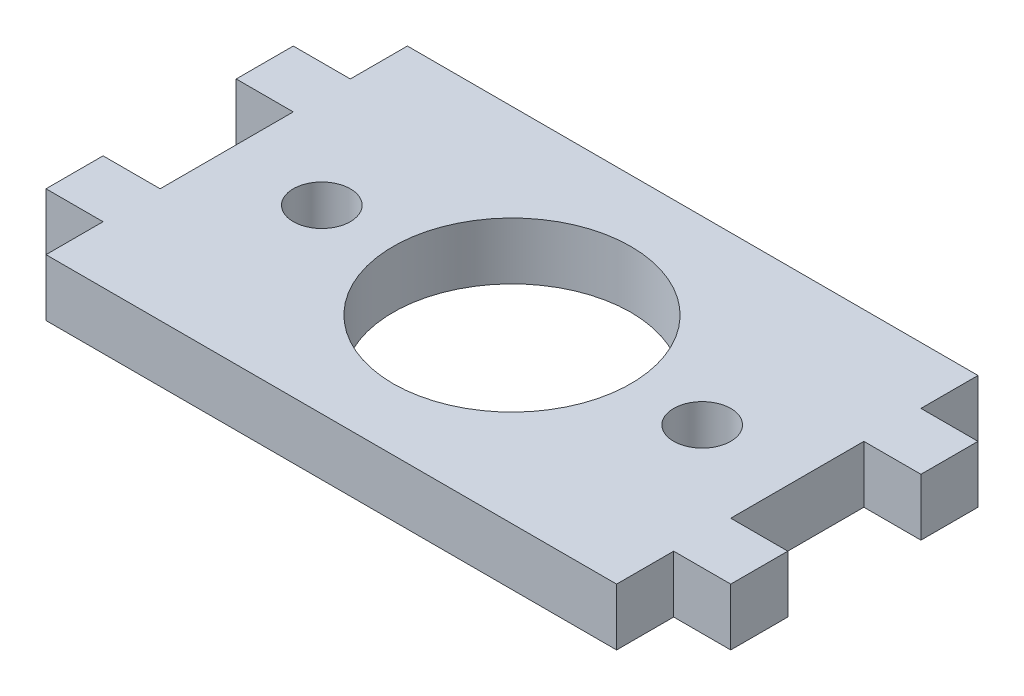
ISO-10303-21;
HEADER;
FILE_DESCRIPTION(('STEP AP214'),'2;1');
FILE_NAME('part.step','',(''),(''),'','','');
FILE_SCHEMA(('AUTOMOTIVE_DESIGN { 1 0 10303 214 1 1 1 1 }'));
ENDSEC;
DATA;
#1=APPLICATION_CONTEXT('core data for automotive mechanical design processes');
#2=APPLICATION_PROTOCOL_DEFINITION('international standard','automotive_design',2000,#1);
#3=PRODUCT_CONTEXT('',#1,'mechanical');
#4=PRODUCT('Part','Part','',(#3));
#5=PRODUCT_RELATED_PRODUCT_CATEGORY('part','',(#4));
#6=PRODUCT_DEFINITION_FORMATION('','',#4);
#7=PRODUCT_DEFINITION_CONTEXT('part definition',#1,'design');
#8=PRODUCT_DEFINITION('design','',#6,#7);
#9=PRODUCT_DEFINITION_SHAPE('','',#8);
#10=(LENGTH_UNIT() NAMED_UNIT(*) SI_UNIT(.MILLI.,.METRE.));
#11=(NAMED_UNIT(*) PLANE_ANGLE_UNIT() SI_UNIT($,.RADIAN.));
#12=(NAMED_UNIT(*) SI_UNIT($,.STERADIAN.) SOLID_ANGLE_UNIT());
#13=UNCERTAINTY_MEASURE_WITH_UNIT(LENGTH_MEASURE(1.E-05),#10,'distance_accuracy_value','');
#14=(GEOMETRIC_REPRESENTATION_CONTEXT(3) GLOBAL_UNCERTAINTY_ASSIGNED_CONTEXT((#13)) GLOBAL_UNIT_ASSIGNED_CONTEXT((#10,
#11,#12)) REPRESENTATION_CONTEXT('',''));
#15=CARTESIAN_POINT('',(0.,0.,0.));
#16=DIRECTION('',(0.,0.,1.));
#17=DIRECTION('',(1.,0.,0.));
#18=AXIS2_PLACEMENT_3D('',#15,#16,#17);
#19=CARTESIAN_POINT('',(0.,3.,0.));
#20=DIRECTION('',(0.,-1.,0.));
#21=DIRECTION('',(0.,0.,-1.));
#22=AXIS2_PLACEMENT_3D('',#19,#20,#21);
#23=PLANE('',#22);
#24=CARTESIAN_POINT('',(-34.8674121918661,3.,-3.5));
#25=DIRECTION('',(0.,1.,0.));
#26=DIRECTION('',(0.,0.,1.));
#27=AXIS2_PLACEMENT_3D('',#24,#25,#26);
#28=CIRCLE('',#27,1.5);
#29=CARTESIAN_POINT('',(-34.8674121918661,3.,-1.99999999999999));
#30=VERTEX_POINT('',#29);
#31=EDGE_CURVE('E389',#30,#30,#28,.T.);
#32=ORIENTED_EDGE('',*,*,#31,.F.);
#33=EDGE_LOOP('',(#32));
#34=FACE_BOUND('',#33,.T.);
#35=DIRECTION('',(1.,0.,0.));
#36=VECTOR('',#35,1.);
#37=CARTESIAN_POINT('',(-39.8674121918661,3.,-7.));
#38=LINE('',#37,#36);
#39=CARTESIAN_POINT('',(-42.8674121918661,3.,-7.));
#40=VERTEX_POINT('',#39);
#41=CARTESIAN_POINT('',(-39.8674121918661,3.,-7.));
#42=VERTEX_POINT('',#41);
#43=EDGE_CURVE('E239',#40,#42,#38,.T.);
#44=ORIENTED_EDGE('',*,*,#43,.T.);
#45=DIRECTION('',(0.,0.,1.));
#46=VECTOR('',#45,1.);
#47=CARTESIAN_POINT('',(-39.8674121918661,3.,0.));
#48=LINE('',#47,#46);
#49=CARTESIAN_POINT('',(-39.8674121918661,3.,0.));
#50=VERTEX_POINT('',#49);
#51=EDGE_CURVE('E127',#42,#50,#48,.T.);
#52=ORIENTED_EDGE('',*,*,#51,.T.);
#53=DIRECTION('',(-1.,0.,0.));
#54=VECTOR('',#53,1.);
#55=CARTESIAN_POINT('',(-42.8674121918661,3.,0.));
#56=LINE('',#55,#54);
#57=CARTESIAN_POINT('',(-42.8674121918661,3.,0.));
#58=VERTEX_POINT('',#57);
#59=EDGE_CURVE('E290',#50,#58,#56,.T.);
#60=ORIENTED_EDGE('',*,*,#59,.T.);
#61=DIRECTION('',(0.,0.,1.));
#62=VECTOR('',#61,1.);
#63=CARTESIAN_POINT('',(-42.8674121918661,3.,3.));
#64=LINE('',#63,#62);
#65=CARTESIAN_POINT('',(-42.8674121918661,3.,3.));
#66=VERTEX_POINT('',#65);
#67=EDGE_CURVE('E309',#58,#66,#64,.T.);
#68=ORIENTED_EDGE('',*,*,#67,.T.);
#69=DIRECTION('',(1.,0.,0.));
#70=VECTOR('',#69,1.);
#71=CARTESIAN_POINT('',(-39.8674121918661,3.,3.));
#72=LINE('',#71,#70);
#73=CARTESIAN_POINT('',(-39.8674121918661,3.,3.));
#74=VERTEX_POINT('',#73);
#75=EDGE_CURVE('E306',#66,#74,#72,.T.);
#76=ORIENTED_EDGE('',*,*,#75,.T.);
#77=DIRECTION('',(0.,0.,1.));
#78=VECTOR('',#77,1.);
#79=CARTESIAN_POINT('',(-39.8674121918661,3.,5.99999999999999));
#80=LINE('',#79,#78);
#81=CARTESIAN_POINT('',(-39.8674121918661,3.,5.99999999999999));
#82=VERTEX_POINT('',#81);
#83=EDGE_CURVE('E308',#74,#82,#80,.T.);
#84=ORIENTED_EDGE('',*,*,#83,.T.);
#85=DIRECTION('',(1.,0.,0.));
#86=VECTOR('',#85,1.);
#87=CARTESIAN_POINT('',(-9.86741219186607,3.,5.99999999999999));
#88=LINE('',#87,#86);
#89=CARTESIAN_POINT('',(-9.86741219186607,3.,5.99999999999999));
#90=VERTEX_POINT('',#89);
#91=EDGE_CURVE('E311',#82,#90,#88,.T.);
#92=ORIENTED_EDGE('',*,*,#91,.T.);
#93=DIRECTION('',(0.,0.,-1.));
#94=VECTOR('',#93,1.);
#95=CARTESIAN_POINT('',(-9.86741219186607,3.,3.));
#96=LINE('',#95,#94);
#97=CARTESIAN_POINT('',(-9.86741219186607,3.,3.));
#98=VERTEX_POINT('',#97);
#99=EDGE_CURVE('E317',#90,#98,#96,.T.);
#100=ORIENTED_EDGE('',*,*,#99,.T.);
#101=DIRECTION('',(1.,0.,0.));
#102=VECTOR('',#101,1.);
#103=CARTESIAN_POINT('',(-6.86741219186606,3.,3.));
#104=LINE('',#103,#102);
#105=CARTESIAN_POINT('',(-6.86741219186606,3.,3.));
#106=VERTEX_POINT('',#105);
#107=EDGE_CURVE('E319',#98,#106,#104,.T.);
#108=ORIENTED_EDGE('',*,*,#107,.T.);
#109=DIRECTION('',(0.,0.,-1.));
#110=VECTOR('',#109,1.);
#111=CARTESIAN_POINT('',(-6.86741219186606,3.,0.));
#112=LINE('',#111,#110);
#113=CARTESIAN_POINT('',(-6.86741219186606,3.,0.));
#114=VERTEX_POINT('',#113);
#115=EDGE_CURVE('E321',#106,#114,#112,.T.);
#116=ORIENTED_EDGE('',*,*,#115,.T.);
#117=DIRECTION('',(-1.,0.,0.));
#118=VECTOR('',#117,1.);
#119=CARTESIAN_POINT('',(-9.86741219186607,3.,0.));
#120=LINE('',#119,#118);
#121=CARTESIAN_POINT('',(-9.86741219186607,3.,0.));
#122=VERTEX_POINT('',#121);
#123=EDGE_CURVE('E323',#114,#122,#120,.T.);
#124=ORIENTED_EDGE('',*,*,#123,.T.);
#125=DIRECTION('',(0.,0.,-1.));
#126=VECTOR('',#125,1.);
#127=CARTESIAN_POINT('',(-9.86741219186607,3.,-7.));
#128=LINE('',#127,#126);
#129=CARTESIAN_POINT('',(-9.86741219186607,3.,-7.));
#130=VERTEX_POINT('',#129);
#131=EDGE_CURVE('E325',#122,#130,#128,.T.);
#132=ORIENTED_EDGE('',*,*,#131,.T.);
#133=DIRECTION('',(1.,0.,0.));
#134=VECTOR('',#133,1.);
#135=CARTESIAN_POINT('',(-6.86741219186607,3.,-7.));
#136=LINE('',#135,#134);
#137=CARTESIAN_POINT('',(-6.86741219186607,3.,-7.));
#138=VERTEX_POINT('',#137);
#139=EDGE_CURVE('E327',#130,#138,#136,.T.);
#140=ORIENTED_EDGE('',*,*,#139,.T.);
#141=DIRECTION('',(0.,0.,-1.));
#142=VECTOR('',#141,1.);
#143=CARTESIAN_POINT('',(-6.86741219186607,3.,-9.99999999999999));
#144=LINE('',#143,#142);
#145=CARTESIAN_POINT('',(-6.86741219186607,3.,-9.99999999999999));
#146=VERTEX_POINT('',#145);
#147=EDGE_CURVE('E329',#138,#146,#144,.T.);
#148=ORIENTED_EDGE('',*,*,#147,.T.);
#149=DIRECTION('',(-1.,0.,0.));
#150=VECTOR('',#149,1.);
#151=CARTESIAN_POINT('',(-9.86741219186607,3.,-9.99999999999999));
#152=LINE('',#151,#150);
#153=CARTESIAN_POINT('',(-9.86741219186607,3.,-9.99999999999999));
#154=VERTEX_POINT('',#153);
#155=EDGE_CURVE('E331',#146,#154,#152,.T.);
#156=ORIENTED_EDGE('',*,*,#155,.T.);
#157=DIRECTION('',(0.,0.,-1.));
#158=VECTOR('',#157,1.);
#159=CARTESIAN_POINT('',(-9.86741219186607,3.,-13.));
#160=LINE('',#159,#158);
#161=CARTESIAN_POINT('',(-9.86741219186607,3.,-13.));
#162=VERTEX_POINT('',#161);
#163=EDGE_CURVE('E333',#154,#162,#160,.T.);
#164=ORIENTED_EDGE('',*,*,#163,.T.);
#165=DIRECTION('',(-1.,0.,0.));
#166=VECTOR('',#165,1.);
#167=CARTESIAN_POINT('',(-39.8674121918661,3.,-13.));
#168=LINE('',#167,#166);
#169=CARTESIAN_POINT('',(-39.8674121918661,3.,-13.));
#170=VERTEX_POINT('',#169);
#171=EDGE_CURVE('E182',#162,#170,#168,.T.);
#172=ORIENTED_EDGE('',*,*,#171,.T.);
#173=DIRECTION('',(0.,0.,1.));
#174=VECTOR('',#173,1.);
#175=CARTESIAN_POINT('',(-39.8674121918661,3.,-9.99999999999999));
#176=LINE('',#175,#174);
#177=CARTESIAN_POINT('',(-39.8674121918661,3.,-9.99999999999999));
#178=VERTEX_POINT('',#177);
#179=EDGE_CURVE('E176',#170,#178,#176,.T.);
#180=ORIENTED_EDGE('',*,*,#179,.T.);
#181=DIRECTION('',(-1.,0.,0.));
#182=VECTOR('',#181,1.);
#183=CARTESIAN_POINT('',(-42.8674121918661,3.,-9.99999999999999));
#184=LINE('',#183,#182);
#185=CARTESIAN_POINT('',(-42.8674121918661,3.,-9.99999999999999));
#186=VERTEX_POINT('',#185);
#187=EDGE_CURVE('E180',#178,#186,#184,.T.);
#188=ORIENTED_EDGE('',*,*,#187,.T.);
#189=DIRECTION('',(0.,0.,1.));
#190=VECTOR('',#189,1.);
#191=CARTESIAN_POINT('',(-42.8674121918661,3.,-7.));
#192=LINE('',#191,#190);
#193=EDGE_CURVE('E48',#186,#40,#192,.T.);
#194=ORIENTED_EDGE('',*,*,#193,.T.);
#195=EDGE_LOOP('',(#44,#52,#60,#68,#76,#84,#92,#100,#108,#116,#124,#132,#140,#148,#156,#164,
#172,#180,#188,#194));
#196=FACE_BOUND('',#195,.T.);
#197=CARTESIAN_POINT('',(-24.8674121918661,3.,-3.5));
#198=DIRECTION('',(0.,1.,0.));
#199=DIRECTION('',(0.,0.,1.));
#200=AXIS2_PLACEMENT_3D('',#197,#198,#199);
#201=CIRCLE('',#200,6.25);
#202=CARTESIAN_POINT('',(-24.8674121918661,3.,2.75));
#203=VERTEX_POINT('',#202);
#204=EDGE_CURVE('E204',#203,#203,#201,.T.);
#205=ORIENTED_EDGE('',*,*,#204,.F.);
#206=EDGE_LOOP('',(#205));
#207=FACE_BOUND('',#206,.T.);
#208=CARTESIAN_POINT('',(-14.8674121918661,3.,-3.50000000000001));
#209=DIRECTION('',(0.,1.,0.));
#210=DIRECTION('',(0.,0.,-1.));
#211=AXIS2_PLACEMENT_3D('',#208,#209,#210);
#212=CIRCLE('',#211,1.5);
#213=CARTESIAN_POINT('',(-14.8674121918661,3.,-5.00000000000001));
#214=VERTEX_POINT('',#213);
#215=EDGE_CURVE('E380',#214,#214,#212,.T.);
#216=ORIENTED_EDGE('',*,*,#215,.F.);
#217=EDGE_LOOP('',(#216));
#218=FACE_BOUND('',#217,.T.);
#219=ADVANCED_FACE('F31',(#34,#196,#207,#218),#23,.F.);
#220=CARTESIAN_POINT('',(0.,0.,0.));
#221=DIRECTION('',(0.,-1.,0.));
#222=DIRECTION('',(0.,0.,-1.));
#223=AXIS2_PLACEMENT_3D('',#220,#221,#222);
#224=PLANE('',#223);
#225=CARTESIAN_POINT('',(-34.8674121918661,0.,-3.5));
#226=DIRECTION('',(0.,1.,0.));
#227=DIRECTION('',(0.,0.,1.));
#228=AXIS2_PLACEMENT_3D('',#225,#226,#227);
#229=CIRCLE('',#228,1.5);
#230=CARTESIAN_POINT('',(-34.8674121918661,0.,-1.99999999999999));
#231=VERTEX_POINT('',#230);
#232=EDGE_CURVE('E386',#231,#231,#229,.T.);
#233=ORIENTED_EDGE('',*,*,#232,.T.);
#234=EDGE_LOOP('',(#233));
#235=FACE_BOUND('',#234,.T.);
#236=DIRECTION('',(1.,0.,0.));
#237=VECTOR('',#236,1.);
#238=CARTESIAN_POINT('',(-39.8674121918661,0.,-7.));
#239=LINE('',#238,#237);
#240=CARTESIAN_POINT('',(-42.8674121918661,0.,-7.));
#241=VERTEX_POINT('',#240);
#242=CARTESIAN_POINT('',(-39.8674121918661,0.,-7.));
#243=VERTEX_POINT('',#242);
#244=EDGE_CURVE('E200',#241,#243,#239,.T.);
#245=ORIENTED_EDGE('',*,*,#244,.F.);
#246=DIRECTION('',(0.,0.,1.));
#247=VECTOR('',#246,1.);
#248=CARTESIAN_POINT('',(-42.8674121918661,0.,-7.));
#249=LINE('',#248,#247);
#250=CARTESIAN_POINT('',(-42.8674121918661,0.,-9.99999999999999));
#251=VERTEX_POINT('',#250);
#252=EDGE_CURVE('E119',#251,#241,#249,.T.);
#253=ORIENTED_EDGE('',*,*,#252,.F.);
#254=DIRECTION('',(-1.,0.,0.));
#255=VECTOR('',#254,1.);
#256=CARTESIAN_POINT('',(-42.8674121918661,0.,-9.99999999999999));
#257=LINE('',#256,#255);
#258=CARTESIAN_POINT('',(-39.8674121918661,0.,-9.99999999999999));
#259=VERTEX_POINT('',#258);
#260=EDGE_CURVE('E113',#259,#251,#257,.T.);
#261=ORIENTED_EDGE('',*,*,#260,.F.);
#262=DIRECTION('',(0.,0.,1.));
#263=VECTOR('',#262,1.);
#264=CARTESIAN_POINT('',(-39.8674121918661,0.,-9.99999999999999));
#265=LINE('',#264,#263);
#266=CARTESIAN_POINT('',(-39.8674121918661,0.,-13.));
#267=VERTEX_POINT('',#266);
#268=EDGE_CURVE('E190',#267,#259,#265,.T.);
#269=ORIENTED_EDGE('',*,*,#268,.F.);
#270=DIRECTION('',(-1.,0.,0.));
#271=VECTOR('',#270,1.);
#272=CARTESIAN_POINT('',(-39.8674121918661,0.,-13.));
#273=LINE('',#272,#271);
#274=CARTESIAN_POINT('',(-9.86741219186607,0.,-13.));
#275=VERTEX_POINT('',#274);
#276=EDGE_CURVE('E234',#275,#267,#273,.T.);
#277=ORIENTED_EDGE('',*,*,#276,.F.);
#278=DIRECTION('',(0.,0.,-1.));
#279=VECTOR('',#278,1.);
#280=CARTESIAN_POINT('',(-9.86741219186607,0.,-13.));
#281=LINE('',#280,#279);
#282=CARTESIAN_POINT('',(-9.86741219186607,0.,-9.99999999999999));
#283=VERTEX_POINT('',#282);
#284=EDGE_CURVE('E232',#283,#275,#281,.T.);
#285=ORIENTED_EDGE('',*,*,#284,.F.);
#286=DIRECTION('',(-1.,0.,0.));
#287=VECTOR('',#286,1.);
#288=CARTESIAN_POINT('',(-9.86741219186607,0.,-9.99999999999999));
#289=LINE('',#288,#287);
#290=CARTESIAN_POINT('',(-6.86741219186607,0.,-9.99999999999999));
#291=VERTEX_POINT('',#290);
#292=EDGE_CURVE('E230',#291,#283,#289,.T.);
#293=ORIENTED_EDGE('',*,*,#292,.F.);
#294=DIRECTION('',(0.,0.,-1.));
#295=VECTOR('',#294,1.);
#296=CARTESIAN_POINT('',(-6.86741219186607,0.,-9.99999999999999));
#297=LINE('',#296,#295);
#298=CARTESIAN_POINT('',(-6.86741219186607,0.,-7.));
#299=VERTEX_POINT('',#298);
#300=EDGE_CURVE('E228',#299,#291,#297,.T.);
#301=ORIENTED_EDGE('',*,*,#300,.F.);
#302=DIRECTION('',(1.,0.,0.));
#303=VECTOR('',#302,1.);
#304=CARTESIAN_POINT('',(-6.86741219186607,0.,-7.));
#305=LINE('',#304,#303);
#306=CARTESIAN_POINT('',(-9.86741219186607,0.,-7.));
#307=VERTEX_POINT('',#306);
#308=EDGE_CURVE('E226',#307,#299,#305,.T.);
#309=ORIENTED_EDGE('',*,*,#308,.F.);
#310=DIRECTION('',(0.,0.,-1.));
#311=VECTOR('',#310,1.);
#312=CARTESIAN_POINT('',(-9.86741219186607,0.,-7.));
#313=LINE('',#312,#311);
#314=CARTESIAN_POINT('',(-9.86741219186607,0.,0.));
#315=VERTEX_POINT('',#314);
#316=EDGE_CURVE('E224',#315,#307,#313,.T.);
#317=ORIENTED_EDGE('',*,*,#316,.F.);
#318=DIRECTION('',(-1.,0.,0.));
#319=VECTOR('',#318,1.);
#320=CARTESIAN_POINT('',(-9.86741219186607,0.,0.));
#321=LINE('',#320,#319);
#322=CARTESIAN_POINT('',(-6.86741219186606,0.,0.));
#323=VERTEX_POINT('',#322);
#324=EDGE_CURVE('E222',#323,#315,#321,.T.);
#325=ORIENTED_EDGE('',*,*,#324,.F.);
#326=DIRECTION('',(0.,0.,-1.));
#327=VECTOR('',#326,1.);
#328=CARTESIAN_POINT('',(-6.86741219186606,0.,0.));
#329=LINE('',#328,#327);
#330=CARTESIAN_POINT('',(-6.86741219186606,0.,3.));
#331=VERTEX_POINT('',#330);
#332=EDGE_CURVE('E220',#331,#323,#329,.T.);
#333=ORIENTED_EDGE('',*,*,#332,.F.);
#334=DIRECTION('',(1.,0.,0.));
#335=VECTOR('',#334,1.);
#336=CARTESIAN_POINT('',(-6.86741219186606,0.,3.));
#337=LINE('',#336,#335);
#338=CARTESIAN_POINT('',(-9.86741219186607,0.,3.));
#339=VERTEX_POINT('',#338);
#340=EDGE_CURVE('E218',#339,#331,#337,.T.);
#341=ORIENTED_EDGE('',*,*,#340,.F.);
#342=DIRECTION('',(0.,0.,-1.));
#343=VECTOR('',#342,1.);
#344=CARTESIAN_POINT('',(-9.86741219186607,0.,3.));
#345=LINE('',#344,#343);
#346=CARTESIAN_POINT('',(-9.86741219186607,0.,5.99999999999999));
#347=VERTEX_POINT('',#346);
#348=EDGE_CURVE('E216',#347,#339,#345,.T.);
#349=ORIENTED_EDGE('',*,*,#348,.F.);
#350=DIRECTION('',(1.,0.,0.));
#351=VECTOR('',#350,1.);
#352=CARTESIAN_POINT('',(-9.86741219186607,0.,5.99999999999999));
#353=LINE('',#352,#351);
#354=CARTESIAN_POINT('',(-39.8674121918661,0.,5.99999999999999));
#355=VERTEX_POINT('',#354);
#356=EDGE_CURVE('E214',#355,#347,#353,.T.);
#357=ORIENTED_EDGE('',*,*,#356,.F.);
#358=DIRECTION('',(0.,0.,1.));
#359=VECTOR('',#358,1.);
#360=CARTESIAN_POINT('',(-39.8674121918661,0.,5.99999999999999));
#361=LINE('',#360,#359);
#362=CARTESIAN_POINT('',(-39.8674121918661,0.,3.));
#363=VERTEX_POINT('',#362);
#364=EDGE_CURVE('E212',#363,#355,#361,.T.);
#365=ORIENTED_EDGE('',*,*,#364,.F.);
#366=DIRECTION('',(1.,0.,0.));
#367=VECTOR('',#366,1.);
#368=CARTESIAN_POINT('',(-39.8674121918661,0.,3.));
#369=LINE('',#368,#367);
#370=CARTESIAN_POINT('',(-42.8674121918661,0.,3.));
#371=VERTEX_POINT('',#370);
#372=EDGE_CURVE('E210',#371,#363,#369,.T.);
#373=ORIENTED_EDGE('',*,*,#372,.F.);
#374=DIRECTION('',(0.,0.,1.));
#375=VECTOR('',#374,1.);
#376=CARTESIAN_POINT('',(-42.8674121918661,0.,3.));
#377=LINE('',#376,#375);
#378=CARTESIAN_POINT('',(-42.8674121918661,0.,0.));
#379=VERTEX_POINT('',#378);
#380=EDGE_CURVE('E208',#379,#371,#377,.T.);
#381=ORIENTED_EDGE('',*,*,#380,.F.);
#382=DIRECTION('',(-1.,0.,0.));
#383=VECTOR('',#382,1.);
#384=CARTESIAN_POINT('',(-42.8674121918661,0.,0.));
#385=LINE('',#384,#383);
#386=CARTESIAN_POINT('',(-39.8674121918661,0.,0.));
#387=VERTEX_POINT('',#386);
#388=EDGE_CURVE('E206',#387,#379,#385,.T.);
#389=ORIENTED_EDGE('',*,*,#388,.F.);
#390=DIRECTION('',(0.,0.,1.));
#391=VECTOR('',#390,1.);
#392=CARTESIAN_POINT('',(-39.8674121918661,0.,0.));
#393=LINE('',#392,#391);
#394=EDGE_CURVE('E203',#243,#387,#393,.T.);
#395=ORIENTED_EDGE('',*,*,#394,.F.);
#396=EDGE_LOOP('',(#245,#253,#261,#269,#277,#285,#293,#301,#309,#317,#325,#333,#341,#349,#357,
#365,#373,#381,#389,#395));
#397=FACE_BOUND('',#396,.T.);
#398=CARTESIAN_POINT('',(-24.8674121918661,0.,-3.5));
#399=DIRECTION('',(0.,1.,0.));
#400=DIRECTION('',(0.,0.,1.));
#401=AXIS2_PLACEMENT_3D('',#398,#399,#400);
#402=CIRCLE('',#401,6.25);
#403=CARTESIAN_POINT('',(-24.8674121918661,0.,2.75));
#404=VERTEX_POINT('',#403);
#405=EDGE_CURVE('E392',#404,#404,#402,.T.);
#406=ORIENTED_EDGE('',*,*,#405,.T.);
#407=EDGE_LOOP('',(#406));
#408=FACE_BOUND('',#407,.T.);
#409=CARTESIAN_POINT('',(-14.8674121918661,0.,-3.50000000000001));
#410=DIRECTION('',(0.,1.,0.));
#411=DIRECTION('',(0.,0.,-1.));
#412=AXIS2_PLACEMENT_3D('',#409,#410,#411);
#413=CIRCLE('',#412,1.5);
#414=CARTESIAN_POINT('',(-14.8674121918661,0.,-5.00000000000001));
#415=VERTEX_POINT('',#414);
#416=EDGE_CURVE('E383',#415,#415,#413,.T.);
#417=ORIENTED_EDGE('',*,*,#416,.T.);
#418=EDGE_LOOP('',(#417));
#419=FACE_BOUND('',#418,.T.);
#420=ADVANCED_FACE('F294',(#235,#397,#408,#419),#224,.T.);
#421=CARTESIAN_POINT('',(-39.8674121918661,3.,-7.));
#422=DIRECTION('',(0.,0.,-1.));
#423=DIRECTION('',(-1.,0.,0.));
#424=AXIS2_PLACEMENT_3D('',#421,#422,#423);
#425=PLANE('',#424);
#426=ORIENTED_EDGE('',*,*,#244,.T.);
#427=DIRECTION('',(0.,-1.,0.));
#428=VECTOR('',#427,1.);
#429=CARTESIAN_POINT('',(-39.8674121918661,3.,-7.));
#430=LINE('',#429,#428);
#431=EDGE_CURVE('E11',#42,#243,#430,.T.);
#432=ORIENTED_EDGE('',*,*,#431,.F.);
#433=ORIENTED_EDGE('',*,*,#43,.F.);
#434=DIRECTION('',(0.,-1.,0.));
#435=VECTOR('',#434,1.);
#436=CARTESIAN_POINT('',(-42.8674121918661,3.,-7.));
#437=LINE('',#436,#435);
#438=EDGE_CURVE('E196',#40,#241,#437,.T.);
#439=ORIENTED_EDGE('',*,*,#438,.T.);
#440=EDGE_LOOP('',(#426,#432,#433,#439));
#441=FACE_BOUND('',#440,.T.);
#442=ADVANCED_FACE('F33',(#441),#425,.F.);
#443=CARTESIAN_POINT('',(-39.8674121918661,3.,0.));
#444=DIRECTION('',(1.,0.,0.));
#445=DIRECTION('',(0.,0.,-1.));
#446=AXIS2_PLACEMENT_3D('',#443,#444,#445);
#447=PLANE('',#446);
#448=ORIENTED_EDGE('',*,*,#394,.T.);
#449=DIRECTION('',(0.,-1.,0.));
#450=VECTOR('',#449,1.);
#451=CARTESIAN_POINT('',(-39.8674121918661,3.,0.));
#452=LINE('',#451,#450);
#453=EDGE_CURVE('E40',#50,#387,#452,.T.);
#454=ORIENTED_EDGE('',*,*,#453,.F.);
#455=ORIENTED_EDGE('',*,*,#51,.F.);
#456=ORIENTED_EDGE('',*,*,#431,.T.);
#457=EDGE_LOOP('',(#448,#454,#455,#456));
#458=FACE_BOUND('',#457,.T.);
#459=ADVANCED_FACE('F573',(#458),#447,.F.);
#460=CARTESIAN_POINT('',(-42.8674121918661,3.,0.));
#461=DIRECTION('',(0.,0.,1.));
#462=DIRECTION('',(1.,0.,0.));
#463=AXIS2_PLACEMENT_3D('',#460,#461,#462);
#464=PLANE('',#463);
#465=ORIENTED_EDGE('',*,*,#388,.T.);
#466=DIRECTION('',(0.,-1.,0.));
#467=VECTOR('',#466,1.);
#468=CARTESIAN_POINT('',(-42.8674121918661,3.,0.));
#469=LINE('',#468,#467);
#470=EDGE_CURVE('E282',#58,#379,#469,.T.);
#471=ORIENTED_EDGE('',*,*,#470,.F.);
#472=ORIENTED_EDGE('',*,*,#59,.F.);
#473=ORIENTED_EDGE('',*,*,#453,.T.);
#474=EDGE_LOOP('',(#465,#471,#472,#473));
#475=FACE_BOUND('',#474,.T.);
#476=ADVANCED_FACE('F288',(#475),#464,.F.);
#477=CARTESIAN_POINT('',(-42.8674121918661,3.,3.));
#478=DIRECTION('',(1.,0.,0.));
#479=DIRECTION('',(0.,0.,-1.));
#480=AXIS2_PLACEMENT_3D('',#477,#478,#479);
#481=PLANE('',#480);
#482=ORIENTED_EDGE('',*,*,#380,.T.);
#483=DIRECTION('',(0.,-1.,0.));
#484=VECTOR('',#483,1.);
#485=CARTESIAN_POINT('',(-42.8674121918661,3.,3.));
#486=LINE('',#485,#484);
#487=EDGE_CURVE('E279',#66,#371,#486,.T.);
#488=ORIENTED_EDGE('',*,*,#487,.F.);
#489=ORIENTED_EDGE('',*,*,#67,.F.);
#490=ORIENTED_EDGE('',*,*,#470,.T.);
#491=EDGE_LOOP('',(#482,#488,#489,#490));
#492=FACE_BOUND('',#491,.T.);
#493=ADVANCED_FACE('F300',(#492),#481,.F.);
#494=CARTESIAN_POINT('',(-39.8674121918661,3.,3.));
#495=DIRECTION('',(0.,0.,-1.));
#496=DIRECTION('',(-1.,0.,0.));
#497=AXIS2_PLACEMENT_3D('',#494,#495,#496);
#498=PLANE('',#497);
#499=ORIENTED_EDGE('',*,*,#372,.T.);
#500=DIRECTION('',(0.,-1.,0.));
#501=VECTOR('',#500,1.);
#502=CARTESIAN_POINT('',(-39.8674121918661,3.,3.));
#503=LINE('',#502,#501);
#504=EDGE_CURVE('E276',#74,#363,#503,.T.);
#505=ORIENTED_EDGE('',*,*,#504,.F.);
#506=ORIENTED_EDGE('',*,*,#75,.F.);
#507=ORIENTED_EDGE('',*,*,#487,.T.);
#508=EDGE_LOOP('',(#499,#505,#506,#507));
#509=FACE_BOUND('',#508,.T.);
#510=ADVANCED_FACE('F304',(#509),#498,.F.);
#511=CARTESIAN_POINT('',(-39.8674121918661,3.,5.99999999999999));
#512=DIRECTION('',(1.,0.,0.));
#513=DIRECTION('',(0.,0.,-1.));
#514=AXIS2_PLACEMENT_3D('',#511,#512,#513);
#515=PLANE('',#514);
#516=ORIENTED_EDGE('',*,*,#364,.T.);
#517=DIRECTION('',(0.,-1.,0.));
#518=VECTOR('',#517,1.);
#519=CARTESIAN_POINT('',(-39.8674121918661,3.,5.99999999999999));
#520=LINE('',#519,#518);
#521=EDGE_CURVE('E273',#82,#355,#520,.T.);
#522=ORIENTED_EDGE('',*,*,#521,.F.);
#523=ORIENTED_EDGE('',*,*,#83,.F.);
#524=ORIENTED_EDGE('',*,*,#504,.T.);
#525=EDGE_LOOP('',(#516,#522,#523,#524));
#526=FACE_BOUND('',#525,.T.);
#527=ADVANCED_FACE('F538',(#526),#515,.F.);
#528=CARTESIAN_POINT('',(-9.86741219186607,3.,5.99999999999999));
#529=DIRECTION('',(0.,0.,-1.));
#530=DIRECTION('',(-1.,0.,0.));
#531=AXIS2_PLACEMENT_3D('',#528,#529,#530);
#532=PLANE('',#531);
#533=ORIENTED_EDGE('',*,*,#356,.T.);
#534=DIRECTION('',(0.,-1.,0.));
#535=VECTOR('',#534,1.);
#536=CARTESIAN_POINT('',(-9.86741219186607,3.,5.99999999999999));
#537=LINE('',#536,#535);
#538=EDGE_CURVE('E270',#90,#347,#537,.T.);
#539=ORIENTED_EDGE('',*,*,#538,.F.);
#540=ORIENTED_EDGE('',*,*,#91,.F.);
#541=ORIENTED_EDGE('',*,*,#521,.T.);
#542=EDGE_LOOP('',(#533,#539,#540,#541));
#543=FACE_BOUND('',#542,.T.);
#544=ADVANCED_FACE('F528',(#543),#532,.F.);
#545=CARTESIAN_POINT('',(-9.86741219186607,3.,3.));
#546=DIRECTION('',(-1.,0.,0.));
#547=DIRECTION('',(0.,0.,1.));
#548=AXIS2_PLACEMENT_3D('',#545,#546,#547);
#549=PLANE('',#548);
#550=ORIENTED_EDGE('',*,*,#348,.T.);
#551=DIRECTION('',(0.,-1.,0.));
#552=VECTOR('',#551,1.);
#553=CARTESIAN_POINT('',(-9.86741219186607,3.,3.));
#554=LINE('',#553,#552);
#555=EDGE_CURVE('E267',#98,#339,#554,.T.);
#556=ORIENTED_EDGE('',*,*,#555,.F.);
#557=ORIENTED_EDGE('',*,*,#99,.F.);
#558=ORIENTED_EDGE('',*,*,#538,.T.);
#559=EDGE_LOOP('',(#550,#556,#557,#558));
#560=FACE_BOUND('',#559,.T.);
#561=ADVANCED_FACE('F518',(#560),#549,.F.);
#562=CARTESIAN_POINT('',(-6.86741219186606,3.,3.));
#563=DIRECTION('',(0.,0.,-1.));
#564=DIRECTION('',(-1.,0.,0.));
#565=AXIS2_PLACEMENT_3D('',#562,#563,#564);
#566=PLANE('',#565);
#567=ORIENTED_EDGE('',*,*,#340,.T.);
#568=DIRECTION('',(0.,-1.,0.));
#569=VECTOR('',#568,1.);
#570=CARTESIAN_POINT('',(-6.86741219186606,3.,3.));
#571=LINE('',#570,#569);
#572=EDGE_CURVE('E264',#106,#331,#571,.T.);
#573=ORIENTED_EDGE('',*,*,#572,.F.);
#574=ORIENTED_EDGE('',*,*,#107,.F.);
#575=ORIENTED_EDGE('',*,*,#555,.T.);
#576=EDGE_LOOP('',(#567,#573,#574,#575));
#577=FACE_BOUND('',#576,.T.);
#578=ADVANCED_FACE('F508',(#577),#566,.F.);
#579=CARTESIAN_POINT('',(-6.86741219186606,3.,0.));
#580=DIRECTION('',(-1.,0.,0.));
#581=DIRECTION('',(0.,0.,1.));
#582=AXIS2_PLACEMENT_3D('',#579,#580,#581);
#583=PLANE('',#582);
#584=ORIENTED_EDGE('',*,*,#332,.T.);
#585=DIRECTION('',(0.,-1.,0.));
#586=VECTOR('',#585,1.);
#587=CARTESIAN_POINT('',(-6.86741219186606,3.,0.));
#588=LINE('',#587,#586);
#589=EDGE_CURVE('E261',#114,#323,#588,.T.);
#590=ORIENTED_EDGE('',*,*,#589,.F.);
#591=ORIENTED_EDGE('',*,*,#115,.F.);
#592=ORIENTED_EDGE('',*,*,#572,.T.);
#593=EDGE_LOOP('',(#584,#590,#591,#592));
#594=FACE_BOUND('',#593,.T.);
#595=ADVANCED_FACE('F498',(#594),#583,.F.);
#596=CARTESIAN_POINT('',(-9.86741219186607,3.,0.));
#597=DIRECTION('',(0.,0.,1.));
#598=DIRECTION('',(1.,0.,0.));
#599=AXIS2_PLACEMENT_3D('',#596,#597,#598);
#600=PLANE('',#599);
#601=ORIENTED_EDGE('',*,*,#324,.T.);
#602=DIRECTION('',(0.,-1.,0.));
#603=VECTOR('',#602,1.);
#604=CARTESIAN_POINT('',(-9.86741219186607,3.,0.));
#605=LINE('',#604,#603);
#606=EDGE_CURVE('E258',#122,#315,#605,.T.);
#607=ORIENTED_EDGE('',*,*,#606,.F.);
#608=ORIENTED_EDGE('',*,*,#123,.F.);
#609=ORIENTED_EDGE('',*,*,#589,.T.);
#610=EDGE_LOOP('',(#601,#607,#608,#609));
#611=FACE_BOUND('',#610,.T.);
#612=ADVANCED_FACE('F488',(#611),#600,.F.);
#613=CARTESIAN_POINT('',(-9.86741219186607,3.,-7.));
#614=DIRECTION('',(-1.,0.,0.));
#615=DIRECTION('',(0.,0.,1.));
#616=AXIS2_PLACEMENT_3D('',#613,#614,#615);
#617=PLANE('',#616);
#618=ORIENTED_EDGE('',*,*,#316,.T.);
#619=DIRECTION('',(0.,-1.,0.));
#620=VECTOR('',#619,1.);
#621=CARTESIAN_POINT('',(-9.86741219186607,3.,-7.));
#622=LINE('',#621,#620);
#623=EDGE_CURVE('E255',#130,#307,#622,.T.);
#624=ORIENTED_EDGE('',*,*,#623,.F.);
#625=ORIENTED_EDGE('',*,*,#131,.F.);
#626=ORIENTED_EDGE('',*,*,#606,.T.);
#627=EDGE_LOOP('',(#618,#624,#625,#626));
#628=FACE_BOUND('',#627,.T.);
#629=ADVANCED_FACE('F478',(#628),#617,.F.);
#630=CARTESIAN_POINT('',(-6.86741219186607,3.,-7.));
#631=DIRECTION('',(0.,0.,-1.));
#632=DIRECTION('',(-1.,0.,0.));
#633=AXIS2_PLACEMENT_3D('',#630,#631,#632);
#634=PLANE('',#633);
#635=ORIENTED_EDGE('',*,*,#308,.T.);
#636=DIRECTION('',(0.,-1.,0.));
#637=VECTOR('',#636,1.);
#638=CARTESIAN_POINT('',(-6.86741219186607,3.,-7.));
#639=LINE('',#638,#637);
#640=EDGE_CURVE('E252',#138,#299,#639,.T.);
#641=ORIENTED_EDGE('',*,*,#640,.F.);
#642=ORIENTED_EDGE('',*,*,#139,.F.);
#643=ORIENTED_EDGE('',*,*,#623,.T.);
#644=EDGE_LOOP('',(#635,#641,#642,#643));
#645=FACE_BOUND('',#644,.T.);
#646=ADVANCED_FACE('F468',(#645),#634,.F.);
#647=CARTESIAN_POINT('',(-6.86741219186607,3.,-9.99999999999999));
#648=DIRECTION('',(-1.,0.,0.));
#649=DIRECTION('',(0.,0.,1.));
#650=AXIS2_PLACEMENT_3D('',#647,#648,#649);
#651=PLANE('',#650);
#652=ORIENTED_EDGE('',*,*,#300,.T.);
#653=DIRECTION('',(0.,-1.,0.));
#654=VECTOR('',#653,1.);
#655=CARTESIAN_POINT('',(-6.86741219186607,3.,-9.99999999999999));
#656=LINE('',#655,#654);
#657=EDGE_CURVE('E249',#146,#291,#656,.T.);
#658=ORIENTED_EDGE('',*,*,#657,.F.);
#659=ORIENTED_EDGE('',*,*,#147,.F.);
#660=ORIENTED_EDGE('',*,*,#640,.T.);
#661=EDGE_LOOP('',(#652,#658,#659,#660));
#662=FACE_BOUND('',#661,.T.);
#663=ADVANCED_FACE('F458',(#662),#651,.F.);
#664=CARTESIAN_POINT('',(-9.86741219186607,3.,-9.99999999999999));
#665=DIRECTION('',(0.,0.,1.));
#666=DIRECTION('',(1.,0.,0.));
#667=AXIS2_PLACEMENT_3D('',#664,#665,#666);
#668=PLANE('',#667);
#669=ORIENTED_EDGE('',*,*,#292,.T.);
#670=DIRECTION('',(0.,-1.,0.));
#671=VECTOR('',#670,1.);
#672=CARTESIAN_POINT('',(-9.86741219186607,3.,-9.99999999999999));
#673=LINE('',#672,#671);
#674=EDGE_CURVE('E246',#154,#283,#673,.T.);
#675=ORIENTED_EDGE('',*,*,#674,.F.);
#676=ORIENTED_EDGE('',*,*,#155,.F.);
#677=ORIENTED_EDGE('',*,*,#657,.T.);
#678=EDGE_LOOP('',(#669,#675,#676,#677));
#679=FACE_BOUND('',#678,.T.);
#680=ADVANCED_FACE('F449',(#679),#668,.F.);
#681=CARTESIAN_POINT('',(-9.86741219186607,3.,-13.));
#682=DIRECTION('',(-1.,0.,0.));
#683=DIRECTION('',(0.,0.,1.));
#684=AXIS2_PLACEMENT_3D('',#681,#682,#683);
#685=PLANE('',#684);
#686=ORIENTED_EDGE('',*,*,#284,.T.);
#687=DIRECTION('',(0.,-1.,0.));
#688=VECTOR('',#687,1.);
#689=CARTESIAN_POINT('',(-9.86741219186607,3.,-13.));
#690=LINE('',#689,#688);
#691=EDGE_CURVE('E243',#162,#275,#690,.T.);
#692=ORIENTED_EDGE('',*,*,#691,.F.);
#693=ORIENTED_EDGE('',*,*,#163,.F.);
#694=ORIENTED_EDGE('',*,*,#674,.T.);
#695=EDGE_LOOP('',(#686,#692,#693,#694));
#696=FACE_BOUND('',#695,.T.);
#697=ADVANCED_FACE('F339',(#696),#685,.F.);
#698=CARTESIAN_POINT('',(-39.8674121918661,3.,-13.));
#699=DIRECTION('',(0.,0.,1.));
#700=DIRECTION('',(1.,0.,0.));
#701=AXIS2_PLACEMENT_3D('',#698,#699,#700);
#702=PLANE('',#701);
#703=ORIENTED_EDGE('',*,*,#276,.T.);
#704=DIRECTION('',(0.,-1.,0.));
#705=VECTOR('',#704,1.);
#706=CARTESIAN_POINT('',(-39.8674121918661,3.,-13.));
#707=LINE('',#706,#705);
#708=EDGE_CURVE('E191',#170,#267,#707,.T.);
#709=ORIENTED_EDGE('',*,*,#708,.F.);
#710=ORIENTED_EDGE('',*,*,#171,.F.);
#711=ORIENTED_EDGE('',*,*,#691,.T.);
#712=EDGE_LOOP('',(#703,#709,#710,#711));
#713=FACE_BOUND('',#712,.T.);
#714=ADVANCED_FACE('F343',(#713),#702,.F.);
#715=CARTESIAN_POINT('',(-39.8674121918661,3.,-9.99999999999999));
#716=DIRECTION('',(1.,0.,0.));
#717=DIRECTION('',(0.,0.,-1.));
#718=AXIS2_PLACEMENT_3D('',#715,#716,#717);
#719=PLANE('',#718);
#720=ORIENTED_EDGE('',*,*,#268,.T.);
#721=DIRECTION('',(0.,-1.,0.));
#722=VECTOR('',#721,1.);
#723=CARTESIAN_POINT('',(-39.8674121918661,3.,-9.99999999999999));
#724=LINE('',#723,#722);
#725=EDGE_CURVE('E187',#178,#259,#724,.T.);
#726=ORIENTED_EDGE('',*,*,#725,.F.);
#727=ORIENTED_EDGE('',*,*,#179,.F.);
#728=ORIENTED_EDGE('',*,*,#708,.T.);
#729=EDGE_LOOP('',(#720,#726,#727,#728));
#730=FACE_BOUND('',#729,.T.);
#731=ADVANCED_FACE('F188',(#730),#719,.F.);
#732=CARTESIAN_POINT('',(-42.8674121918661,3.,-9.99999999999999));
#733=DIRECTION('',(0.,0.,1.));
#734=DIRECTION('',(1.,0.,0.));
#735=AXIS2_PLACEMENT_3D('',#732,#733,#734);
#736=PLANE('',#735);
#737=ORIENTED_EDGE('',*,*,#260,.T.);
#738=DIRECTION('',(0.,-1.,0.));
#739=VECTOR('',#738,1.);
#740=CARTESIAN_POINT('',(-42.8674121918661,3.,-9.99999999999999));
#741=LINE('',#740,#739);
#742=EDGE_CURVE('E192',#186,#251,#741,.T.);
#743=ORIENTED_EDGE('',*,*,#742,.F.);
#744=ORIENTED_EDGE('',*,*,#187,.F.);
#745=ORIENTED_EDGE('',*,*,#725,.T.);
#746=EDGE_LOOP('',(#737,#743,#744,#745));
#747=FACE_BOUND('',#746,.T.);
#748=ADVANCED_FACE('F194',(#747),#736,.F.);
#749=CARTESIAN_POINT('',(-42.8674121918661,3.,-7.));
#750=DIRECTION('',(1.,0.,0.));
#751=DIRECTION('',(0.,0.,-1.));
#752=AXIS2_PLACEMENT_3D('',#749,#750,#751);
#753=PLANE('',#752);
#754=ORIENTED_EDGE('',*,*,#252,.T.);
#755=ORIENTED_EDGE('',*,*,#438,.F.);
#756=ORIENTED_EDGE('',*,*,#193,.F.);
#757=ORIENTED_EDGE('',*,*,#742,.T.);
#758=EDGE_LOOP('',(#754,#755,#756,#757));
#759=FACE_BOUND('',#758,.T.);
#760=ADVANCED_FACE('F347',(#759),#753,.F.);
#761=CARTESIAN_POINT('',(-24.8674121918661,3.,-3.5));
#762=DIRECTION('',(0.,-1.,0.));
#763=DIRECTION('',(0.,0.,-1.));
#764=AXIS2_PLACEMENT_3D('',#761,#762,#763);
#765=CYLINDRICAL_SURFACE('',#764,6.25);
#766=ORIENTED_EDGE('',*,*,#204,.T.);
#767=EDGE_LOOP('',(#766));
#768=FACE_BOUND('',#767,.T.);
#769=ORIENTED_EDGE('',*,*,#405,.F.);
#770=EDGE_LOOP('',(#769));
#771=FACE_BOUND('',#770,.T.);
#772=ADVANCED_FACE('F349',(#768,#771),#765,.F.);
#773=CARTESIAN_POINT('',(-34.8674121918661,3.,-3.5));
#774=DIRECTION('',(0.,-1.,0.));
#775=DIRECTION('',(0.,0.,-1.));
#776=AXIS2_PLACEMENT_3D('',#773,#774,#775);
#777=CYLINDRICAL_SURFACE('',#776,1.5);
#778=ORIENTED_EDGE('',*,*,#31,.T.);
#779=EDGE_LOOP('',(#778));
#780=FACE_BOUND('',#779,.T.);
#781=ORIENTED_EDGE('',*,*,#232,.F.);
#782=EDGE_LOOP('',(#781));
#783=FACE_BOUND('',#782,.T.);
#784=ADVANCED_FACE('F355',(#780,#783),#777,.F.);
#785=CARTESIAN_POINT('',(-14.8674121918661,3.,-3.50000000000001));
#786=DIRECTION('',(0.,-1.,0.));
#787=DIRECTION('',(0.,0.,-1.));
#788=AXIS2_PLACEMENT_3D('',#785,#786,#787);
#789=CYLINDRICAL_SURFACE('',#788,1.5);
#790=ORIENTED_EDGE('',*,*,#215,.T.);
#791=EDGE_LOOP('',(#790));
#792=FACE_BOUND('',#791,.T.);
#793=ORIENTED_EDGE('',*,*,#416,.F.);
#794=EDGE_LOOP('',(#793));
#795=FACE_BOUND('',#794,.T.);
#796=ADVANCED_FACE('F371',(#792,#795),#789,.F.);
#797=CLOSED_SHELL('',(#219,#420,#442,#459,#476,#493,#510,#527,#544,#561,#578,#595,#612,#629,
#646,#663,#680,#697,#714,#731,#748,#760,#772,#784,#796));
#798=MANIFOLD_SOLID_BREP('B2',#797);
#799=ADVANCED_BREP_SHAPE_REPRESENTATION('',(#18,#798),#14);
#800=SHAPE_DEFINITION_REPRESENTATION(#9,#799);
ENDSEC;
END-ISO-10303-21;
